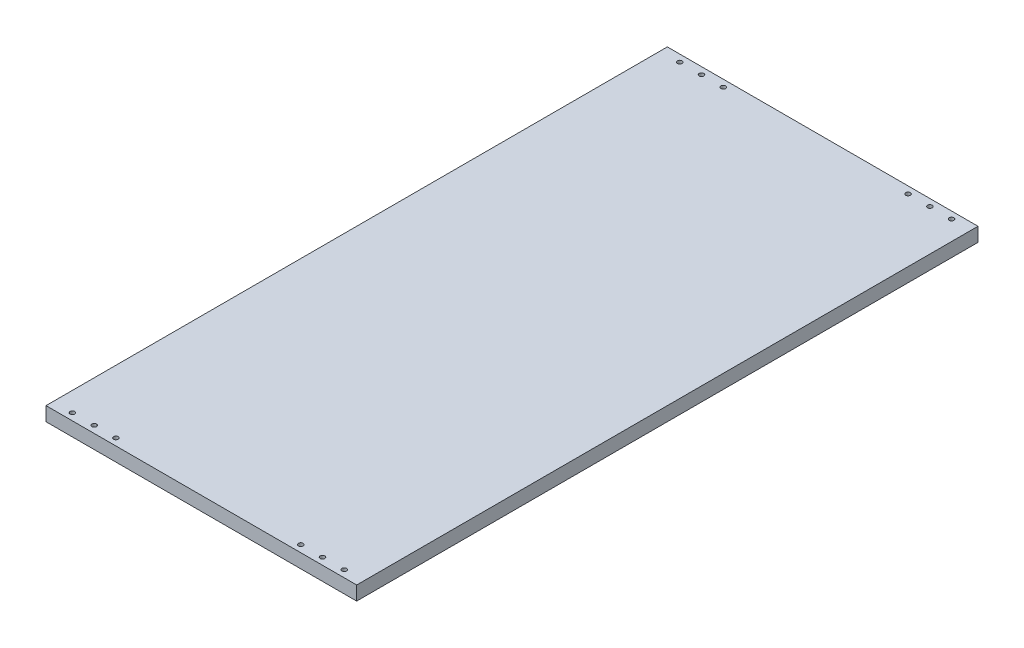
ISO-10303-21;
HEADER;
FILE_DESCRIPTION(('STEP AP214'),'2;1');
FILE_NAME('part.step','',(''),(''),'','','');
FILE_SCHEMA(('AUTOMOTIVE_DESIGN { 1 0 10303 214 1 1 1 1 }'));
ENDSEC;
DATA;
#1=APPLICATION_CONTEXT('core data for automotive mechanical design processes');
#2=APPLICATION_PROTOCOL_DEFINITION('international standard','automotive_design',2000,#1);
#3=PRODUCT_CONTEXT('',#1,'mechanical');
#4=PRODUCT('Part','Part','',(#3));
#5=PRODUCT_RELATED_PRODUCT_CATEGORY('part','',(#4));
#6=PRODUCT_DEFINITION_FORMATION('','',#4);
#7=PRODUCT_DEFINITION_CONTEXT('part definition',#1,'design');
#8=PRODUCT_DEFINITION('design','',#6,#7);
#9=PRODUCT_DEFINITION_SHAPE('','',#8);
#10=(LENGTH_UNIT() NAMED_UNIT(*) SI_UNIT(.MILLI.,.METRE.));
#11=(NAMED_UNIT(*) PLANE_ANGLE_UNIT() SI_UNIT($,.RADIAN.));
#12=(NAMED_UNIT(*) SI_UNIT($,.STERADIAN.) SOLID_ANGLE_UNIT());
#13=UNCERTAINTY_MEASURE_WITH_UNIT(LENGTH_MEASURE(1.E-05),#10,'distance_accuracy_value','');
#14=(GEOMETRIC_REPRESENTATION_CONTEXT(3) GLOBAL_UNCERTAINTY_ASSIGNED_CONTEXT((#13)) GLOBAL_UNIT_ASSIGNED_CONTEXT((#10,
#11,#12)) REPRESENTATION_CONTEXT('',''));
#15=CARTESIAN_POINT('',(0.,0.,0.));
#16=DIRECTION('',(0.,0.,1.));
#17=DIRECTION('',(1.,0.,0.));
#18=AXIS2_PLACEMENT_3D('',#15,#16,#17);
#19=CARTESIAN_POINT('',(0.,18.,0.));
#20=DIRECTION('',(1.,0.,0.));
#21=DIRECTION('',(0.,0.,-1.));
#22=AXIS2_PLACEMENT_3D('',#19,#20,#21);
#23=PLANE('',#22);
#24=DIRECTION('',(0.,0.,1.));
#25=VECTOR('',#24,1.);
#26=CARTESIAN_POINT('',(0.,0.,0.));
#27=LINE('',#26,#25);
#28=CARTESIAN_POINT('',(0.,0.,-800.));
#29=VERTEX_POINT('',#28);
#30=CARTESIAN_POINT('',(0.,0.,0.));
#31=VERTEX_POINT('',#30);
#32=EDGE_CURVE('E97',#29,#31,#27,.T.);
#33=ORIENTED_EDGE('',*,*,#32,.T.);
#34=DIRECTION('',(0.,-1.,0.));
#35=VECTOR('',#34,1.);
#36=CARTESIAN_POINT('',(0.,18.,0.));
#37=LINE('',#36,#35);
#38=CARTESIAN_POINT('',(0.,18.,0.));
#39=VERTEX_POINT('',#38);
#40=EDGE_CURVE('E11',#39,#31,#37,.T.);
#41=ORIENTED_EDGE('',*,*,#40,.F.);
#42=DIRECTION('',(0.,0.,1.));
#43=VECTOR('',#42,1.);
#44=CARTESIAN_POINT('',(0.,18.,0.));
#45=LINE('',#44,#43);
#46=CARTESIAN_POINT('',(0.,18.,-800.));
#47=VERTEX_POINT('',#46);
#48=EDGE_CURVE('E85',#47,#39,#45,.T.);
#49=ORIENTED_EDGE('',*,*,#48,.F.);
#50=DIRECTION('',(0.,-1.,0.));
#51=VECTOR('',#50,1.);
#52=CARTESIAN_POINT('',(0.,18.,-800.));
#53=LINE('',#52,#51);
#54=EDGE_CURVE('E93',#47,#29,#53,.T.);
#55=ORIENTED_EDGE('',*,*,#54,.T.);
#56=EDGE_LOOP('',(#33,#41,#49,#55));
#57=FACE_BOUND('',#56,.T.);
#58=ADVANCED_FACE('F34',(#57),#23,.F.);
#59=CARTESIAN_POINT('',(0.,18.,0.));
#60=DIRECTION('',(0.,0.,-1.));
#61=DIRECTION('',(-1.,0.,0.));
#62=AXIS2_PLACEMENT_3D('',#59,#60,#61);
#63=PLANE('',#62);
#64=DIRECTION('',(1.,0.,0.));
#65=VECTOR('',#64,1.);
#66=CARTESIAN_POINT('',(0.,0.,0.));
#67=LINE('',#66,#65);
#68=CARTESIAN_POINT('',(400.,0.,0.));
#69=VERTEX_POINT('',#68);
#70=EDGE_CURVE('E89',#31,#69,#67,.T.);
#71=ORIENTED_EDGE('',*,*,#70,.T.);
#72=DIRECTION('',(0.,-1.,0.));
#73=VECTOR('',#72,1.);
#74=CARTESIAN_POINT('',(400.,18.,0.));
#75=LINE('',#74,#73);
#76=CARTESIAN_POINT('',(400.,18.,0.));
#77=VERTEX_POINT('',#76);
#78=EDGE_CURVE('E42',#77,#69,#75,.T.);
#79=ORIENTED_EDGE('',*,*,#78,.F.);
#80=DIRECTION('',(1.,0.,0.));
#81=VECTOR('',#80,1.);
#82=CARTESIAN_POINT('',(0.,18.,0.));
#83=LINE('',#82,#81);
#84=EDGE_CURVE('E80',#39,#77,#83,.T.);
#85=ORIENTED_EDGE('',*,*,#84,.F.);
#86=ORIENTED_EDGE('',*,*,#40,.T.);
#87=EDGE_LOOP('',(#71,#79,#85,#86));
#88=FACE_BOUND('',#87,.T.);
#89=ADVANCED_FACE('F88',(#88),#63,.F.);
#90=CARTESIAN_POINT('',(400.,18.,0.));
#91=DIRECTION('',(-1.,0.,0.));
#92=DIRECTION('',(0.,0.,1.));
#93=AXIS2_PLACEMENT_3D('',#90,#91,#92);
#94=PLANE('',#93);
#95=DIRECTION('',(0.,0.,-1.));
#96=VECTOR('',#95,1.);
#97=CARTESIAN_POINT('',(400.,0.,0.));
#98=LINE('',#97,#96);
#99=CARTESIAN_POINT('',(400.,0.,-800.));
#100=VERTEX_POINT('',#99);
#101=EDGE_CURVE('E67',#69,#100,#98,.T.);
#102=ORIENTED_EDGE('',*,*,#101,.T.);
#103=DIRECTION('',(0.,-1.,0.));
#104=VECTOR('',#103,1.);
#105=CARTESIAN_POINT('',(400.,18.,-800.));
#106=LINE('',#105,#104);
#107=CARTESIAN_POINT('',(400.,18.,-800.));
#108=VERTEX_POINT('',#107);
#109=EDGE_CURVE('E90',#108,#100,#106,.T.);
#110=ORIENTED_EDGE('',*,*,#109,.F.);
#111=DIRECTION('',(0.,0.,-1.));
#112=VECTOR('',#111,1.);
#113=CARTESIAN_POINT('',(400.,18.,0.));
#114=LINE('',#113,#112);
#115=EDGE_CURVE('E83',#77,#108,#114,.T.);
#116=ORIENTED_EDGE('',*,*,#115,.F.);
#117=ORIENTED_EDGE('',*,*,#78,.T.);
#118=EDGE_LOOP('',(#102,#110,#116,#117));
#119=FACE_BOUND('',#118,.T.);
#120=ADVANCED_FACE('F91',(#119),#94,.F.);
#121=CARTESIAN_POINT('',(0.,18.,-800.));
#122=DIRECTION('',(0.,0.,1.));
#123=DIRECTION('',(1.,0.,0.));
#124=AXIS2_PLACEMENT_3D('',#121,#122,#123);
#125=PLANE('',#124);
#126=DIRECTION('',(-1.,0.,0.));
#127=VECTOR('',#126,1.);
#128=CARTESIAN_POINT('',(0.,0.,-800.));
#129=LINE('',#128,#127);
#130=EDGE_CURVE('E73',#100,#29,#129,.T.);
#131=ORIENTED_EDGE('',*,*,#130,.T.);
#132=ORIENTED_EDGE('',*,*,#54,.F.);
#133=DIRECTION('',(-1.,0.,0.));
#134=VECTOR('',#133,1.);
#135=CARTESIAN_POINT('',(0.,18.,-800.));
#136=LINE('',#135,#134);
#137=EDGE_CURVE('E50',#108,#47,#136,.T.);
#138=ORIENTED_EDGE('',*,*,#137,.F.);
#139=ORIENTED_EDGE('',*,*,#109,.T.);
#140=EDGE_LOOP('',(#131,#132,#138,#139));
#141=FACE_BOUND('',#140,.T.);
#142=ADVANCED_FACE('F105',(#141),#125,.F.);
#143=CARTESIAN_POINT('',(0.,18.,0.));
#144=DIRECTION('',(0.,-1.,0.));
#145=DIRECTION('',(0.,0.,-1.));
#146=AXIS2_PLACEMENT_3D('',#143,#144,#145);
#147=PLANE('',#146);
#148=CARTESIAN_POINT('',(319.,18.,-791.));
#149=DIRECTION('',(0.,1.,0.));
#150=DIRECTION('',(0.,0.,1.));
#151=AXIS2_PLACEMENT_3D('',#148,#149,#150);
#152=CIRCLE('',#151,3.00000000000005);
#153=CARTESIAN_POINT('',(319.,18.,-788.));
#154=VERTEX_POINT('',#153);
#155=EDGE_CURVE('E141',#154,#154,#152,.T.);
#156=ORIENTED_EDGE('',*,*,#155,.F.);
#157=EDGE_LOOP('',(#156));
#158=FACE_BOUND('',#157,.T.);
#159=CARTESIAN_POINT('',(347.,18.,-791.));
#160=DIRECTION('',(0.,1.,0.));
#161=DIRECTION('',(0.,0.,1.));
#162=AXIS2_PLACEMENT_3D('',#159,#160,#161);
#163=CIRCLE('',#162,2.99999999999999);
#164=CARTESIAN_POINT('',(347.,18.,-788.));
#165=VERTEX_POINT('',#164);
#166=EDGE_CURVE('E148',#165,#165,#163,.T.);
#167=ORIENTED_EDGE('',*,*,#166,.F.);
#168=EDGE_LOOP('',(#167));
#169=FACE_BOUND('',#168,.T.);
#170=CARTESIAN_POINT('',(375.,18.,-791.));
#171=DIRECTION('',(0.,1.,0.));
#172=DIRECTION('',(0.,0.,1.));
#173=AXIS2_PLACEMENT_3D('',#170,#171,#172);
#174=CIRCLE('',#173,2.99999999999999);
#175=CARTESIAN_POINT('',(375.,18.,-788.));
#176=VERTEX_POINT('',#175);
#177=EDGE_CURVE('E154',#176,#176,#174,.T.);
#178=ORIENTED_EDGE('',*,*,#177,.F.);
#179=EDGE_LOOP('',(#178));
#180=FACE_BOUND('',#179,.T.);
#181=CARTESIAN_POINT('',(375.,18.,-9.00000000000004));
#182=DIRECTION('',(0.,1.,0.));
#183=DIRECTION('',(0.,0.,-1.));
#184=AXIS2_PLACEMENT_3D('',#181,#182,#183);
#185=CIRCLE('',#184,2.99999999999999);
#186=CARTESIAN_POINT('',(375.,18.,-12.));
#187=VERTEX_POINT('',#186);
#188=EDGE_CURVE('E160',#187,#187,#185,.T.);
#189=ORIENTED_EDGE('',*,*,#188,.F.);
#190=EDGE_LOOP('',(#189));
#191=FACE_BOUND('',#190,.T.);
#192=CARTESIAN_POINT('',(347.,18.,-9.00000000000004));
#193=DIRECTION('',(0.,1.,0.));
#194=DIRECTION('',(0.,0.,-1.));
#195=AXIS2_PLACEMENT_3D('',#192,#193,#194);
#196=CIRCLE('',#195,2.99999999999999);
#197=CARTESIAN_POINT('',(347.,18.,-12.));
#198=VERTEX_POINT('',#197);
#199=EDGE_CURVE('E117',#198,#198,#196,.T.);
#200=ORIENTED_EDGE('',*,*,#199,.F.);
#201=EDGE_LOOP('',(#200));
#202=FACE_BOUND('',#201,.T.);
#203=CARTESIAN_POINT('',(319.,18.,-9.00000000000003));
#204=DIRECTION('',(0.,1.,0.));
#205=DIRECTION('',(0.,0.,-1.));
#206=AXIS2_PLACEMENT_3D('',#203,#204,#205);
#207=CIRCLE('',#206,3.00000000000005);
#208=CARTESIAN_POINT('',(319.,18.,-12.0000000000001));
#209=VERTEX_POINT('',#208);
#210=EDGE_CURVE('E124',#209,#209,#207,.T.);
#211=ORIENTED_EDGE('',*,*,#210,.F.);
#212=EDGE_LOOP('',(#211));
#213=FACE_BOUND('',#212,.T.);
#214=CARTESIAN_POINT('',(81.,18.,-9.));
#215=DIRECTION('',(0.,1.,0.));
#216=DIRECTION('',(0.,0.,1.));
#217=AXIS2_PLACEMENT_3D('',#214,#215,#216);
#218=CIRCLE('',#217,3.00000000000001);
#219=CARTESIAN_POINT('',(81.,18.,-5.99999999999999));
#220=VERTEX_POINT('',#219);
#221=EDGE_CURVE('E130',#220,#220,#218,.T.);
#222=ORIENTED_EDGE('',*,*,#221,.F.);
#223=EDGE_LOOP('',(#222));
#224=FACE_BOUND('',#223,.T.);
#225=CARTESIAN_POINT('',(53.,18.,-9.));
#226=DIRECTION('',(0.,1.,0.));
#227=DIRECTION('',(0.,0.,1.));
#228=AXIS2_PLACEMENT_3D('',#225,#226,#227);
#229=CIRCLE('',#228,2.99999999999999);
#230=CARTESIAN_POINT('',(53.,18.,-6.00000000000001));
#231=VERTEX_POINT('',#230);
#232=EDGE_CURVE('E136',#231,#231,#229,.T.);
#233=ORIENTED_EDGE('',*,*,#232,.F.);
#234=EDGE_LOOP('',(#233));
#235=FACE_BOUND('',#234,.T.);
#236=CARTESIAN_POINT('',(81.,18.,-791.));
#237=DIRECTION('',(0.,1.,0.));
#238=DIRECTION('',(0.,0.,-1.));
#239=AXIS2_PLACEMENT_3D('',#236,#237,#238);
#240=CIRCLE('',#239,3.00000000000001);
#241=CARTESIAN_POINT('',(81.,18.,-794.));
#242=VERTEX_POINT('',#241);
#243=EDGE_CURVE('E177',#242,#242,#240,.T.);
#244=ORIENTED_EDGE('',*,*,#243,.F.);
#245=EDGE_LOOP('',(#244));
#246=FACE_BOUND('',#245,.T.);
#247=CARTESIAN_POINT('',(53.,18.,-791.));
#248=DIRECTION('',(0.,1.,0.));
#249=DIRECTION('',(0.,0.,-1.));
#250=AXIS2_PLACEMENT_3D('',#247,#248,#249);
#251=CIRCLE('',#250,2.99999999999999);
#252=CARTESIAN_POINT('',(53.,18.,-794.));
#253=VERTEX_POINT('',#252);
#254=EDGE_CURVE('E171',#253,#253,#251,.T.);
#255=ORIENTED_EDGE('',*,*,#254,.F.);
#256=EDGE_LOOP('',(#255));
#257=FACE_BOUND('',#256,.T.);
#258=CARTESIAN_POINT('',(25.,18.,-791.));
#259=DIRECTION('',(0.,1.,0.));
#260=DIRECTION('',(0.,0.,-1.));
#261=AXIS2_PLACEMENT_3D('',#258,#259,#260);
#262=CIRCLE('',#261,3.);
#263=CARTESIAN_POINT('',(25.,18.,-794.));
#264=VERTEX_POINT('',#263);
#265=EDGE_CURVE('E165',#264,#264,#262,.T.);
#266=ORIENTED_EDGE('',*,*,#265,.F.);
#267=EDGE_LOOP('',(#266));
#268=FACE_BOUND('',#267,.T.);
#269=CARTESIAN_POINT('',(25.,18.,-9.));
#270=DIRECTION('',(0.,1.,0.));
#271=DIRECTION('',(0.,0.,1.));
#272=AXIS2_PLACEMENT_3D('',#269,#270,#271);
#273=CIRCLE('',#272,3.);
#274=CARTESIAN_POINT('',(25.,18.,-6.));
#275=VERTEX_POINT('',#274);
#276=EDGE_CURVE('E111',#275,#275,#273,.T.);
#277=ORIENTED_EDGE('',*,*,#276,.F.);
#278=EDGE_LOOP('',(#277));
#279=FACE_BOUND('',#278,.T.);
#280=ORIENTED_EDGE('',*,*,#48,.T.);
#281=ORIENTED_EDGE('',*,*,#84,.T.);
#282=ORIENTED_EDGE('',*,*,#115,.T.);
#283=ORIENTED_EDGE('',*,*,#137,.T.);
#284=EDGE_LOOP('',(#280,#281,#282,#283));
#285=FACE_BOUND('',#284,.T.);
#286=ADVANCED_FACE('F81',(#158,#169,#180,#191,#202,#213,#224,#235,#246,#257,#268,#279,#285),
#147,.F.);
#287=CARTESIAN_POINT('',(0.,0.,0.));
#288=DIRECTION('',(0.,-1.,0.));
#289=DIRECTION('',(0.,0.,-1.));
#290=AXIS2_PLACEMENT_3D('',#287,#288,#289);
#291=PLANE('',#290);
#292=ORIENTED_EDGE('',*,*,#32,.F.);
#293=ORIENTED_EDGE('',*,*,#130,.F.);
#294=ORIENTED_EDGE('',*,*,#101,.F.);
#295=ORIENTED_EDGE('',*,*,#70,.F.);
#296=EDGE_LOOP('',(#292,#293,#294,#295));
#297=FACE_BOUND('',#296,.T.);
#298=ADVANCED_FACE('F108',(#297),#291,.T.);
#299=CARTESIAN_POINT('',(25.,9.,-9.));
#300=DIRECTION('',(0.,1.,0.));
#301=DIRECTION('',(0.,0.,1.));
#302=AXIS2_PLACEMENT_3D('',#299,#300,#301);
#303=CYLINDRICAL_SURFACE('',#302,3.);
#304=CARTESIAN_POINT('',(25.,9.,-9.));
#305=DIRECTION('',(0.,1.,0.));
#306=DIRECTION('',(0.,0.,1.));
#307=AXIS2_PLACEMENT_3D('',#304,#305,#306);
#308=CIRCLE('',#307,3.);
#309=CARTESIAN_POINT('',(25.,9.,-6.));
#310=VERTEX_POINT('',#309);
#311=EDGE_CURVE('E100',#310,#310,#308,.T.);
#312=ORIENTED_EDGE('',*,*,#311,.F.);
#313=EDGE_LOOP('',(#312));
#314=FACE_BOUND('',#313,.T.);
#315=ORIENTED_EDGE('',*,*,#276,.T.);
#316=EDGE_LOOP('',(#315));
#317=FACE_BOUND('',#316,.T.);
#318=ADVANCED_FACE('F202',(#314,#317),#303,.F.);
#319=CARTESIAN_POINT('',(25.,9.,-9.));
#320=DIRECTION('',(0.,1.,0.));
#321=DIRECTION('',(0.,0.,1.));
#322=AXIS2_PLACEMENT_3D('',#319,#320,#321);
#323=PLANE('',#322);
#324=ORIENTED_EDGE('',*,*,#311,.T.);
#325=EDGE_LOOP('',(#324));
#326=FACE_BOUND('',#325,.T.);
#327=ADVANCED_FACE('F204',(#326),#323,.T.);
#328=CARTESIAN_POINT('',(25.,9.,-791.));
#329=DIRECTION('',(0.,1.,0.));
#330=DIRECTION('',(0.,0.,1.));
#331=AXIS2_PLACEMENT_3D('',#328,#329,#330);
#332=CYLINDRICAL_SURFACE('',#331,3.);
#333=CARTESIAN_POINT('',(25.,9.,-791.));
#334=DIRECTION('',(0.,1.,0.));
#335=DIRECTION('',(0.,0.,-1.));
#336=AXIS2_PLACEMENT_3D('',#333,#334,#335);
#337=CIRCLE('',#336,3.);
#338=CARTESIAN_POINT('',(25.,9.,-794.));
#339=VERTEX_POINT('',#338);
#340=EDGE_CURVE('E168',#339,#339,#337,.T.);
#341=ORIENTED_EDGE('',*,*,#340,.F.);
#342=EDGE_LOOP('',(#341));
#343=FACE_BOUND('',#342,.T.);
#344=ORIENTED_EDGE('',*,*,#265,.T.);
#345=EDGE_LOOP('',(#344));
#346=FACE_BOUND('',#345,.T.);
#347=ADVANCED_FACE('F211',(#343,#346),#332,.F.);
#348=CARTESIAN_POINT('',(25.,9.,-791.));
#349=DIRECTION('',(0.,-1.,0.));
#350=DIRECTION('',(0.,0.,-1.));
#351=AXIS2_PLACEMENT_3D('',#348,#349,#350);
#352=PLANE('',#351);
#353=ORIENTED_EDGE('',*,*,#340,.T.);
#354=EDGE_LOOP('',(#353));
#355=FACE_BOUND('',#354,.T.);
#356=ADVANCED_FACE('F259',(#355),#352,.F.);
#357=CARTESIAN_POINT('',(53.,9.,-791.));
#358=DIRECTION('',(0.,1.,0.));
#359=DIRECTION('',(0.,0.,1.));
#360=AXIS2_PLACEMENT_3D('',#357,#358,#359);
#361=CYLINDRICAL_SURFACE('',#360,2.99999999999999);
#362=CARTESIAN_POINT('',(53.,9.,-791.));
#363=DIRECTION('',(0.,1.,0.));
#364=DIRECTION('',(0.,0.,-1.));
#365=AXIS2_PLACEMENT_3D('',#362,#363,#364);
#366=CIRCLE('',#365,2.99999999999999);
#367=CARTESIAN_POINT('',(53.,9.,-794.));
#368=VERTEX_POINT('',#367);
#369=EDGE_CURVE('E174',#368,#368,#366,.T.);
#370=ORIENTED_EDGE('',*,*,#369,.F.);
#371=EDGE_LOOP('',(#370));
#372=FACE_BOUND('',#371,.T.);
#373=ORIENTED_EDGE('',*,*,#254,.T.);
#374=EDGE_LOOP('',(#373));
#375=FACE_BOUND('',#374,.T.);
#376=ADVANCED_FACE('F268',(#372,#375),#361,.F.);
#377=CARTESIAN_POINT('',(53.,9.,-791.));
#378=DIRECTION('',(0.,-1.,0.));
#379=DIRECTION('',(0.,0.,-1.));
#380=AXIS2_PLACEMENT_3D('',#377,#378,#379);
#381=PLANE('',#380);
#382=ORIENTED_EDGE('',*,*,#369,.T.);
#383=EDGE_LOOP('',(#382));
#384=FACE_BOUND('',#383,.T.);
#385=ADVANCED_FACE('F188',(#384),#381,.F.);
#386=CARTESIAN_POINT('',(81.,9.,-791.));
#387=DIRECTION('',(0.,1.,0.));
#388=DIRECTION('',(0.,0.,1.));
#389=AXIS2_PLACEMENT_3D('',#386,#387,#388);
#390=CYLINDRICAL_SURFACE('',#389,3.00000000000001);
#391=CARTESIAN_POINT('',(81.,9.,-791.));
#392=DIRECTION('',(0.,1.,0.));
#393=DIRECTION('',(0.,0.,-1.));
#394=AXIS2_PLACEMENT_3D('',#391,#392,#393);
#395=CIRCLE('',#394,3.00000000000001);
#396=CARTESIAN_POINT('',(81.,9.,-794.));
#397=VERTEX_POINT('',#396);
#398=EDGE_CURVE('E145',#397,#397,#395,.T.);
#399=ORIENTED_EDGE('',*,*,#398,.F.);
#400=EDGE_LOOP('',(#399));
#401=FACE_BOUND('',#400,.T.);
#402=ORIENTED_EDGE('',*,*,#243,.T.);
#403=EDGE_LOOP('',(#402));
#404=FACE_BOUND('',#403,.T.);
#405=ADVANCED_FACE('F185',(#401,#404),#390,.F.);
#406=CARTESIAN_POINT('',(81.,9.,-791.));
#407=DIRECTION('',(0.,-1.,0.));
#408=DIRECTION('',(0.,0.,-1.));
#409=AXIS2_PLACEMENT_3D('',#406,#407,#408);
#410=PLANE('',#409);
#411=ORIENTED_EDGE('',*,*,#398,.T.);
#412=EDGE_LOOP('',(#411));
#413=FACE_BOUND('',#412,.T.);
#414=ADVANCED_FACE('F183',(#413),#410,.F.);
#415=CARTESIAN_POINT('',(53.,9.,-9.));
#416=DIRECTION('',(0.,1.,0.));
#417=DIRECTION('',(0.,0.,1.));
#418=AXIS2_PLACEMENT_3D('',#415,#416,#417);
#419=CYLINDRICAL_SURFACE('',#418,2.99999999999999);
#420=CARTESIAN_POINT('',(53.,9.,-9.));
#421=DIRECTION('',(0.,1.,0.));
#422=DIRECTION('',(0.,0.,1.));
#423=AXIS2_PLACEMENT_3D('',#420,#421,#422);
#424=CIRCLE('',#423,2.99999999999999);
#425=CARTESIAN_POINT('',(53.,9.,-6.00000000000001));
#426=VERTEX_POINT('',#425);
#427=EDGE_CURVE('E114',#426,#426,#424,.T.);
#428=ORIENTED_EDGE('',*,*,#427,.F.);
#429=EDGE_LOOP('',(#428));
#430=FACE_BOUND('',#429,.T.);
#431=ORIENTED_EDGE('',*,*,#232,.T.);
#432=EDGE_LOOP('',(#431));
#433=FACE_BOUND('',#432,.T.);
#434=ADVANCED_FACE('F298',(#430,#433),#419,.F.);
#435=CARTESIAN_POINT('',(53.,9.,-9.));
#436=DIRECTION('',(0.,1.,0.));
#437=DIRECTION('',(0.,0.,1.));
#438=AXIS2_PLACEMENT_3D('',#435,#436,#437);
#439=PLANE('',#438);
#440=ORIENTED_EDGE('',*,*,#427,.T.);
#441=EDGE_LOOP('',(#440));
#442=FACE_BOUND('',#441,.T.);
#443=ADVANCED_FACE('F306',(#442),#439,.T.);
#444=CARTESIAN_POINT('',(81.,9.,-9.));
#445=DIRECTION('',(0.,1.,0.));
#446=DIRECTION('',(0.,0.,1.));
#447=AXIS2_PLACEMENT_3D('',#444,#445,#446);
#448=CYLINDRICAL_SURFACE('',#447,3.00000000000001);
#449=CARTESIAN_POINT('',(81.,9.,-9.));
#450=DIRECTION('',(0.,1.,0.));
#451=DIRECTION('',(0.,0.,1.));
#452=AXIS2_PLACEMENT_3D('',#449,#450,#451);
#453=CIRCLE('',#452,3.00000000000001);
#454=CARTESIAN_POINT('',(81.,9.,-5.99999999999999));
#455=VERTEX_POINT('',#454);
#456=EDGE_CURVE('E133',#455,#455,#453,.T.);
#457=ORIENTED_EDGE('',*,*,#456,.F.);
#458=EDGE_LOOP('',(#457));
#459=FACE_BOUND('',#458,.T.);
#460=ORIENTED_EDGE('',*,*,#221,.T.);
#461=EDGE_LOOP('',(#460));
#462=FACE_BOUND('',#461,.T.);
#463=ADVANCED_FACE('F315',(#459,#462),#448,.F.);
#464=CARTESIAN_POINT('',(81.,9.,-9.));
#465=DIRECTION('',(0.,1.,0.));
#466=DIRECTION('',(0.,0.,1.));
#467=AXIS2_PLACEMENT_3D('',#464,#465,#466);
#468=PLANE('',#467);
#469=ORIENTED_EDGE('',*,*,#456,.T.);
#470=EDGE_LOOP('',(#469));
#471=FACE_BOUND('',#470,.T.);
#472=ADVANCED_FACE('F324',(#471),#468,.T.);
#473=CARTESIAN_POINT('',(319.,9.,-9.00000000000003));
#474=DIRECTION('',(0.,1.,0.));
#475=DIRECTION('',(0.,0.,1.));
#476=AXIS2_PLACEMENT_3D('',#473,#474,#475);
#477=CYLINDRICAL_SURFACE('',#476,3.00000000000005);
#478=CARTESIAN_POINT('',(319.,9.,-9.00000000000003));
#479=DIRECTION('',(0.,1.,0.));
#480=DIRECTION('',(0.,0.,-1.));
#481=AXIS2_PLACEMENT_3D('',#478,#479,#480);
#482=CIRCLE('',#481,3.00000000000005);
#483=CARTESIAN_POINT('',(319.,9.,-12.0000000000001));
#484=VERTEX_POINT('',#483);
#485=EDGE_CURVE('E127',#484,#484,#482,.T.);
#486=ORIENTED_EDGE('',*,*,#485,.F.);
#487=EDGE_LOOP('',(#486));
#488=FACE_BOUND('',#487,.T.);
#489=ORIENTED_EDGE('',*,*,#210,.T.);
#490=EDGE_LOOP('',(#489));
#491=FACE_BOUND('',#490,.T.);
#492=ADVANCED_FACE('F333',(#488,#491),#477,.F.);
#493=CARTESIAN_POINT('',(319.,9.,-9.00000000000003));
#494=DIRECTION('',(0.,-1.,0.));
#495=DIRECTION('',(0.,0.,-1.));
#496=AXIS2_PLACEMENT_3D('',#493,#494,#495);
#497=PLANE('',#496);
#498=ORIENTED_EDGE('',*,*,#485,.T.);
#499=EDGE_LOOP('',(#498));
#500=FACE_BOUND('',#499,.T.);
#501=ADVANCED_FACE('F342',(#500),#497,.F.);
#502=CARTESIAN_POINT('',(347.,9.,-9.00000000000004));
#503=DIRECTION('',(0.,1.,0.));
#504=DIRECTION('',(0.,0.,1.));
#505=AXIS2_PLACEMENT_3D('',#502,#503,#504);
#506=CYLINDRICAL_SURFACE('',#505,2.99999999999999);
#507=CARTESIAN_POINT('',(347.,9.,-9.00000000000004));
#508=DIRECTION('',(0.,1.,0.));
#509=DIRECTION('',(0.,0.,-1.));
#510=AXIS2_PLACEMENT_3D('',#507,#508,#509);
#511=CIRCLE('',#510,2.99999999999999);
#512=CARTESIAN_POINT('',(347.,9.,-12.));
#513=VERTEX_POINT('',#512);
#514=EDGE_CURVE('E120',#513,#513,#511,.T.);
#515=ORIENTED_EDGE('',*,*,#514,.F.);
#516=EDGE_LOOP('',(#515));
#517=FACE_BOUND('',#516,.T.);
#518=ORIENTED_EDGE('',*,*,#199,.T.);
#519=EDGE_LOOP('',(#518));
#520=FACE_BOUND('',#519,.T.);
#521=ADVANCED_FACE('F351',(#517,#520),#506,.F.);
#522=CARTESIAN_POINT('',(347.,9.,-9.00000000000004));
#523=DIRECTION('',(0.,-1.,0.));
#524=DIRECTION('',(0.,0.,-1.));
#525=AXIS2_PLACEMENT_3D('',#522,#523,#524);
#526=PLANE('',#525);
#527=ORIENTED_EDGE('',*,*,#514,.T.);
#528=EDGE_LOOP('',(#527));
#529=FACE_BOUND('',#528,.T.);
#530=ADVANCED_FACE('F360',(#529),#526,.F.);
#531=CARTESIAN_POINT('',(375.,9.,-9.00000000000004));
#532=DIRECTION('',(0.,1.,0.));
#533=DIRECTION('',(0.,0.,1.));
#534=AXIS2_PLACEMENT_3D('',#531,#532,#533);
#535=CYLINDRICAL_SURFACE('',#534,2.99999999999999);
#536=CARTESIAN_POINT('',(375.,9.,-9.00000000000004));
#537=DIRECTION('',(0.,1.,0.));
#538=DIRECTION('',(0.,0.,-1.));
#539=AXIS2_PLACEMENT_3D('',#536,#537,#538);
#540=CIRCLE('',#539,2.99999999999999);
#541=CARTESIAN_POINT('',(375.,9.,-12.));
#542=VERTEX_POINT('',#541);
#543=EDGE_CURVE('E121',#542,#542,#540,.T.);
#544=ORIENTED_EDGE('',*,*,#543,.F.);
#545=EDGE_LOOP('',(#544));
#546=FACE_BOUND('',#545,.T.);
#547=ORIENTED_EDGE('',*,*,#188,.T.);
#548=EDGE_LOOP('',(#547));
#549=FACE_BOUND('',#548,.T.);
#550=ADVANCED_FACE('F369',(#546,#549),#535,.F.);
#551=CARTESIAN_POINT('',(375.,9.,-9.00000000000004));
#552=DIRECTION('',(0.,-1.,0.));
#553=DIRECTION('',(0.,0.,-1.));
#554=AXIS2_PLACEMENT_3D('',#551,#552,#553);
#555=PLANE('',#554);
#556=ORIENTED_EDGE('',*,*,#543,.T.);
#557=EDGE_LOOP('',(#556));
#558=FACE_BOUND('',#557,.T.);
#559=ADVANCED_FACE('F378',(#558),#555,.F.);
#560=CARTESIAN_POINT('',(375.,9.,-791.));
#561=DIRECTION('',(0.,1.,0.));
#562=DIRECTION('',(0.,0.,1.));
#563=AXIS2_PLACEMENT_3D('',#560,#561,#562);
#564=CYLINDRICAL_SURFACE('',#563,2.99999999999999);
#565=CARTESIAN_POINT('',(375.,9.,-791.));
#566=DIRECTION('',(0.,1.,0.));
#567=DIRECTION('',(0.,0.,1.));
#568=AXIS2_PLACEMENT_3D('',#565,#566,#567);
#569=CIRCLE('',#568,2.99999999999999);
#570=CARTESIAN_POINT('',(375.,9.,-788.));
#571=VERTEX_POINT('',#570);
#572=EDGE_CURVE('E157',#571,#571,#569,.T.);
#573=ORIENTED_EDGE('',*,*,#572,.F.);
#574=EDGE_LOOP('',(#573));
#575=FACE_BOUND('',#574,.T.);
#576=ORIENTED_EDGE('',*,*,#177,.T.);
#577=EDGE_LOOP('',(#576));
#578=FACE_BOUND('',#577,.T.);
#579=ADVANCED_FACE('F387',(#575,#578),#564,.F.);
#580=CARTESIAN_POINT('',(375.,9.,-791.));
#581=DIRECTION('',(0.,1.,0.));
#582=DIRECTION('',(0.,0.,1.));
#583=AXIS2_PLACEMENT_3D('',#580,#581,#582);
#584=PLANE('',#583);
#585=ORIENTED_EDGE('',*,*,#572,.T.);
#586=EDGE_LOOP('',(#585));
#587=FACE_BOUND('',#586,.T.);
#588=ADVANCED_FACE('F396',(#587),#584,.T.);
#589=CARTESIAN_POINT('',(347.,9.,-791.));
#590=DIRECTION('',(0.,1.,0.));
#591=DIRECTION('',(0.,0.,1.));
#592=AXIS2_PLACEMENT_3D('',#589,#590,#591);
#593=CYLINDRICAL_SURFACE('',#592,2.99999999999999);
#594=CARTESIAN_POINT('',(347.,9.,-791.));
#595=DIRECTION('',(0.,1.,0.));
#596=DIRECTION('',(0.,0.,1.));
#597=AXIS2_PLACEMENT_3D('',#594,#595,#596);
#598=CIRCLE('',#597,2.99999999999999);
#599=CARTESIAN_POINT('',(347.,9.,-788.));
#600=VERTEX_POINT('',#599);
#601=EDGE_CURVE('E151',#600,#600,#598,.T.);
#602=ORIENTED_EDGE('',*,*,#601,.F.);
#603=EDGE_LOOP('',(#602));
#604=FACE_BOUND('',#603,.T.);
#605=ORIENTED_EDGE('',*,*,#166,.T.);
#606=EDGE_LOOP('',(#605));
#607=FACE_BOUND('',#606,.T.);
#608=ADVANCED_FACE('F405',(#604,#607),#593,.F.);
#609=CARTESIAN_POINT('',(347.,9.,-791.));
#610=DIRECTION('',(0.,1.,0.));
#611=DIRECTION('',(0.,0.,1.));
#612=AXIS2_PLACEMENT_3D('',#609,#610,#611);
#613=PLANE('',#612);
#614=ORIENTED_EDGE('',*,*,#601,.T.);
#615=EDGE_LOOP('',(#614));
#616=FACE_BOUND('',#615,.T.);
#617=ADVANCED_FACE('F414',(#616),#613,.T.);
#618=CARTESIAN_POINT('',(319.,9.,-791.));
#619=DIRECTION('',(0.,1.,0.));
#620=DIRECTION('',(0.,0.,1.));
#621=AXIS2_PLACEMENT_3D('',#618,#619,#620);
#622=CYLINDRICAL_SURFACE('',#621,3.00000000000005);
#623=CARTESIAN_POINT('',(319.,9.,-791.));
#624=DIRECTION('',(0.,1.,0.));
#625=DIRECTION('',(0.,0.,1.));
#626=AXIS2_PLACEMENT_3D('',#623,#624,#625);
#627=CIRCLE('',#626,3.00000000000005);
#628=CARTESIAN_POINT('',(319.,9.,-788.));
#629=VERTEX_POINT('',#628);
#630=EDGE_CURVE('E144',#629,#629,#627,.T.);
#631=ORIENTED_EDGE('',*,*,#630,.F.);
#632=EDGE_LOOP('',(#631));
#633=FACE_BOUND('',#632,.T.);
#634=ORIENTED_EDGE('',*,*,#155,.T.);
#635=EDGE_LOOP('',(#634));
#636=FACE_BOUND('',#635,.T.);
#637=ADVANCED_FACE('F423',(#633,#636),#622,.F.);
#638=CARTESIAN_POINT('',(319.,9.,-791.));
#639=DIRECTION('',(0.,1.,0.));
#640=DIRECTION('',(0.,0.,1.));
#641=AXIS2_PLACEMENT_3D('',#638,#639,#640);
#642=PLANE('',#641);
#643=ORIENTED_EDGE('',*,*,#630,.T.);
#644=EDGE_LOOP('',(#643));
#645=FACE_BOUND('',#644,.T.);
#646=ADVANCED_FACE('F432',(#645),#642,.T.);
#647=CLOSED_SHELL('',(#58,#89,#120,#142,#286,#298,#318,#327,#347,#356,#376,#385,#405,#414,#434,
#443,#463,#472,#492,#501,#521,#530,#550,#559,#579,#588,#608,#617,#637,#646));
#648=MANIFOLD_SOLID_BREP('B2',#647);
#649=ADVANCED_BREP_SHAPE_REPRESENTATION('',(#18,#648),#14);
#650=SHAPE_DEFINITION_REPRESENTATION(#9,#649);
ENDSEC;
END-ISO-10303-21;
